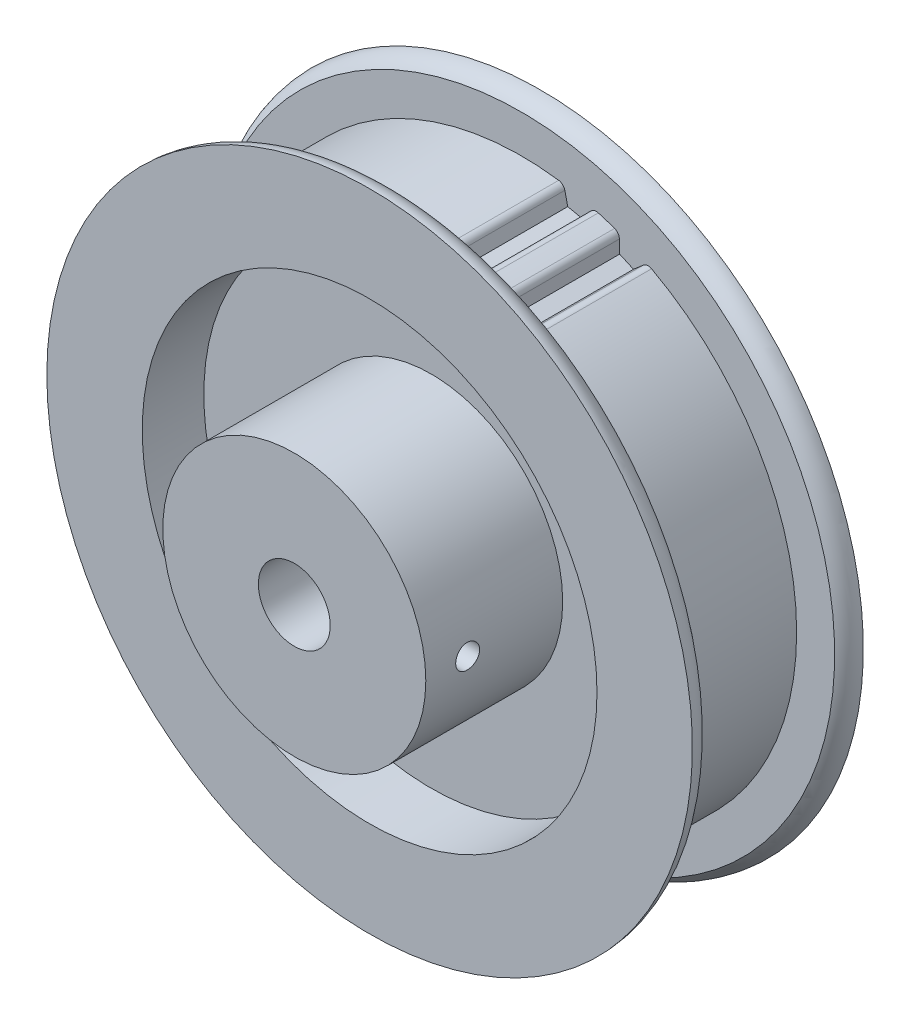
ISO-10303-21;
HEADER;
FILE_DESCRIPTION(('STEP AP214'),'2;1');
FILE_NAME('part.step','',(''),(''),'','','');
FILE_SCHEMA(('AUTOMOTIVE_DESIGN { 1 0 10303 214 1 1 1 1 }'));
ENDSEC;
DATA;
#1=APPLICATION_CONTEXT('core data for automotive mechanical design processes');
#2=APPLICATION_PROTOCOL_DEFINITION('international standard','automotive_design',2000,#1);
#3=PRODUCT_CONTEXT('',#1,'mechanical');
#4=PRODUCT('Part','Part','',(#3));
#5=PRODUCT_RELATED_PRODUCT_CATEGORY('part','',(#4));
#6=PRODUCT_DEFINITION_FORMATION('','',#4);
#7=PRODUCT_DEFINITION_CONTEXT('part definition',#1,'design');
#8=PRODUCT_DEFINITION('design','',#6,#7);
#9=PRODUCT_DEFINITION_SHAPE('','',#8);
#10=(LENGTH_UNIT() NAMED_UNIT(*) SI_UNIT(.MILLI.,.METRE.));
#11=(NAMED_UNIT(*) PLANE_ANGLE_UNIT() SI_UNIT($,.RADIAN.));
#12=(NAMED_UNIT(*) SI_UNIT($,.STERADIAN.) SOLID_ANGLE_UNIT());
#13=UNCERTAINTY_MEASURE_WITH_UNIT(LENGTH_MEASURE(1.E-05),#10,'distance_accuracy_value','');
#14=(GEOMETRIC_REPRESENTATION_CONTEXT(3) GLOBAL_UNCERTAINTY_ASSIGNED_CONTEXT((#13)) GLOBAL_UNIT_ASSIGNED_CONTEXT((#10,
#11,#12)) REPRESENTATION_CONTEXT('',''));
#15=CARTESIAN_POINT('',(0.,0.,0.));
#16=DIRECTION('',(0.,0.,1.));
#17=DIRECTION('',(1.,0.,0.));
#18=AXIS2_PLACEMENT_3D('',#15,#16,#17);
#19=CARTESIAN_POINT('',(0.,0.,-7.865));
#20=DIRECTION('',(0.,0.,1.));
#21=DIRECTION('',(1.,0.,0.));
#22=AXIS2_PLACEMENT_3D('',#19,#20,#21);
#23=CYLINDRICAL_SURFACE('',#22,3.00625);
#24=CARTESIAN_POINT('',(0.,0.,13.45));
#25=DIRECTION('',(0.,0.,1.));
#26=DIRECTION('',(1.,0.,0.));
#27=AXIS2_PLACEMENT_3D('',#24,#25,#26);
#28=CIRCLE('',#27,3.00625);
#29=CARTESIAN_POINT('',(3.00625,0.,13.45));
#30=VERTEX_POINT('',#29);
#31=EDGE_CURVE('E668',#30,#30,#28,.F.);
#32=ORIENTED_EDGE('',*,*,#31,.F.);
#33=EDGE_LOOP('',(#32));
#34=FACE_BOUND('',#33,.T.);
#35=CARTESIAN_POINT('',(2.83505538967054,-1.,9.95));
#36=CARTESIAN_POINT('',(2.83505805521726,-0.999996860829534,9.89560012240531));
#37=CARTESIAN_POINT('',(2.83664092720275,-0.995539628982452,9.84114356229328));
#38=CARTESIAN_POINT('',(2.84278029352672,-0.977866267559119,9.73378845301384));
#39=CARTESIAN_POINT('',(2.84734185394725,-0.964635215082974,9.68089271894788));
#40=CARTESIAN_POINT('',(2.85886276493882,-0.929932047551878,9.57831487311199));
#41=CARTESIAN_POINT('',(2.86581595404735,-0.908481093078195,9.52862488936154));
#42=CARTESIAN_POINT('',(2.88132861772083,-0.85800851131405,9.43355077888805));
#43=CARTESIAN_POINT('',(2.88988794328122,-0.828987586207924,9.38816625332639));
#44=CARTESIAN_POINT('',(2.90802514645595,-0.762980154462313,9.30119659752729));
#45=CARTESIAN_POINT('',(2.91762839752182,-0.725747418235904,9.25980357147626));
#46=CARTESIAN_POINT('',(2.9365572425231,-0.644897226191834,9.18371667960365));
#47=CARTESIAN_POINT('',(2.94588277761681,-0.601278428732987,9.14902422505916));
#48=CARTESIAN_POINT('',(2.96349731218182,-0.507497701326585,9.0864585773574));
#49=CARTESIAN_POINT('',(2.97175313863212,-0.457195363937249,9.05878567814415));
#50=CARTESIAN_POINT('',(2.98600044492719,-0.352328255845483,9.01237001183178));
#51=CARTESIAN_POINT('',(2.99199254200767,-0.297764651937208,8.9936248101141));
#52=CARTESIAN_POINT('',(3.00085820819363,-0.18793067543891,8.9662452880797));
#53=CARTESIAN_POINT('',(3.00383266206768,-0.132750339237902,8.95728305985227));
#54=CARTESIAN_POINT('',(3.00668595141732,-0.0215942380519739,8.94868139573731));
#55=CARTESIAN_POINT('',(3.0065655808289,0.0343813192469164,8.94903956882523));
#56=CARTESIAN_POINT('',(3.00331121605878,0.143218101675799,8.95886027092679));
#57=CARTESIAN_POINT('',(3.00029512433452,0.19611556885254,8.96796661718219));
#58=CARTESIAN_POINT('',(2.99173611710719,0.299583787679702,8.9944363792984));
#59=CARTESIAN_POINT('',(2.98619302001733,0.350154371836262,9.0118003885463));
#60=CARTESIAN_POINT('',(2.97305224963023,0.448314503969328,9.05450171799445));
#61=CARTESIAN_POINT('',(2.96542853618524,0.495856149440983,9.07994080977365));
#62=CARTESIAN_POINT('',(2.9489209370939,0.586098821903409,9.13798504182922));
#63=CARTESIAN_POINT('',(2.94003676787983,0.628798755742992,9.17059179554078));
#64=CARTESIAN_POINT('',(2.92145432368061,0.710261444445991,9.24383625581745));
#65=CARTESIAN_POINT('',(2.91173740613105,0.748746825603025,9.28477813729732));
#66=CARTESIAN_POINT('',(2.89293146373067,0.818408421259538,9.37263406604175));
#67=CARTESIAN_POINT('',(2.88384274942274,0.849581038774795,9.41955103488553));
#68=CARTESIAN_POINT('',(2.86721813322962,0.904116550311982,9.518916082822));
#69=CARTESIAN_POINT('',(2.85970728458455,0.927356644993606,9.57143592929314));
#70=CARTESIAN_POINT('',(2.84738666422368,0.964529947944262,9.6798999307465));
#71=CARTESIAN_POINT('',(2.84257116596637,0.978482899708677,9.73583654366407));
#72=CARTESIAN_POINT('',(2.83797968136899,0.991678199536366,9.8185815857425));
#73=CARTESIAN_POINT('',(2.83688686383255,0.994794901889274,9.84475160224009));
#74=CARTESIAN_POINT('',(2.83542407020799,0.998956567971282,9.89727663943035));
#75=CARTESIAN_POINT('',(2.83505409764486,1.00000152159737,9.92363166102458));
#76=CARTESIAN_POINT('',(2.83505805521726,0.999996860829534,10.0043998775947));
#77=CARTESIAN_POINT('',(2.83664092720275,0.995539628982452,10.0588564377067));
#78=CARTESIAN_POINT('',(2.84278029352672,0.977866267559119,10.1662115469862));
#79=CARTESIAN_POINT('',(2.84734185394725,0.964635215082974,10.2191072810521));
#80=CARTESIAN_POINT('',(2.85886276493882,0.929932047551878,10.321685126888));
#81=CARTESIAN_POINT('',(2.86581595404735,0.908481093078195,10.3713751106385));
#82=CARTESIAN_POINT('',(2.88132861772083,0.858008511314049,10.4664492211119));
#83=CARTESIAN_POINT('',(2.88988794328122,0.828987586207924,10.5118337466736));
#84=CARTESIAN_POINT('',(2.90802514645595,0.762980154462313,10.5988034024727));
#85=CARTESIAN_POINT('',(2.91762839752182,0.725747418235904,10.6401964285237));
#86=CARTESIAN_POINT('',(2.9365572425231,0.644897226191834,10.7162833203963));
#87=CARTESIAN_POINT('',(2.94588277761681,0.601278428732987,10.7509757749408));
#88=CARTESIAN_POINT('',(2.96349731218182,0.507497701326584,10.8135414226426));
#89=CARTESIAN_POINT('',(2.97175313863212,0.457195363937248,10.8412143218558));
#90=CARTESIAN_POINT('',(2.98600044492719,0.352328255845482,10.8876299881682));
#91=CARTESIAN_POINT('',(2.99199254200767,0.297764651937208,10.9063751898859));
#92=CARTESIAN_POINT('',(3.00085820819363,0.18793067543891,10.9337547119203));
#93=CARTESIAN_POINT('',(3.00383266206768,0.132750339237901,10.9427169401477));
#94=CARTESIAN_POINT('',(3.00668595141732,0.0215942380519736,10.9513186042627));
#95=CARTESIAN_POINT('',(3.0065655808289,-0.0343813192469166,10.9509604311748));
#96=CARTESIAN_POINT('',(3.00331121605878,-0.143218101675799,10.9411397290732));
#97=CARTESIAN_POINT('',(3.00029512433452,-0.19611556885254,10.9320333828178));
#98=CARTESIAN_POINT('',(2.99173611710719,-0.299583787679702,10.9055636207016));
#99=CARTESIAN_POINT('',(2.98619302001733,-0.350154371836262,10.8881996114537));
#100=CARTESIAN_POINT('',(2.97305224963023,-0.448314503969328,10.8454982820055));
#101=CARTESIAN_POINT('',(2.96542853618524,-0.495856149440983,10.8200591902263));
#102=CARTESIAN_POINT('',(2.9489209370939,-0.586098821903409,10.7620149581708));
#103=CARTESIAN_POINT('',(2.94003676787983,-0.628798755742992,10.7294082044592));
#104=CARTESIAN_POINT('',(2.92145432368061,-0.710261444445991,10.6561637441825));
#105=CARTESIAN_POINT('',(2.91173740613105,-0.748746825603025,10.6152218627027));
#106=CARTESIAN_POINT('',(2.89293146373067,-0.818408421259538,10.5273659339582));
#107=CARTESIAN_POINT('',(2.88384274942274,-0.849581038774795,10.4804489651145));
#108=CARTESIAN_POINT('',(2.86721813322962,-0.904116550311982,10.381083917178));
#109=CARTESIAN_POINT('',(2.85970728458455,-0.927356644993605,10.3285640707069));
#110=CARTESIAN_POINT('',(2.84738666422368,-0.964529947944262,10.2201000692535));
#111=CARTESIAN_POINT('',(2.84257116596637,-0.978482899708677,10.1641634563359));
#112=CARTESIAN_POINT('',(2.83797968136899,-0.991678199536366,10.0814184142575));
#113=CARTESIAN_POINT('',(2.83688686383255,-0.994794901889274,10.0552483977599));
#114=CARTESIAN_POINT('',(2.83542407020799,-0.998956567971282,10.0027233605696));
#115=CARTESIAN_POINT('',(2.83505409764486,-1.00000152159737,9.97636833897542));
#116=CARTESIAN_POINT('',(2.83505538967054,-1.,9.95));
#117=B_SPLINE_CURVE_WITH_KNOTS('',3,(#35,#36,#37,#38,#39,#40,#41,#42,#43,#44,#45,#46,#47,#48,
#49,#50,#51,#52,#53,#54,#55,#56,#57,#58,#59,#60,#61,#62,#63,#64,#65,#66,#67,#68,#69,#70,#71,#72,
#73,#74,#75,#76,#77,#78,#79,#80,#81,#82,#83,#84,#85,#86,#87,#88,#89,#90,#91,#92,#93,#94,#95,#96,
#97,#98,#99,#100,#101,#102,#103,#104,#105,#106,#107,#108,#109,#110,#111,#112,#113,#114,#115,
#116),.UNSPECIFIED.,.T.,.F.,(4,2,2,2,2,2,2,2,2,2,2,2,2,2,2,2,2,2,2,2,2,2,2,2,2,2,2,2,2,2,2,2,2,
2,2,2,2,2,2,2,4),(0.,0.163097193528566,0.326472503894794,0.489430030630399,0.652372446929972,
0.82110001060895,0.989863073094611,1.16300499130044,1.33609966594337,1.50319520005849,
1.67024786846742,1.83077509092815,1.99131385045194,2.15396209645025,2.31664699200341,
2.48693714412507,2.65731088333809,2.83021371070307,3.00274778061822,3.0818027583693,
3.16085812163579,3.32395531516436,3.48733062553059,3.65028815226619,3.81323056856576,
3.98195813224474,4.1507211947304,4.32386311293623,4.49695778757916,4.66405332169428,
4.83110599010321,4.99163321256395,5.15217197208773,5.31482021808604,5.4775051136392,
5.64779526576086,5.81816900497388,5.99107183233886,6.16360590225401,6.2426608800051,
6.32171624327158),.UNSPECIFIED.);
#118=CARTESIAN_POINT('',(2.83505538967054,-1.,9.95));
#119=VERTEX_POINT('',#118);
#120=EDGE_CURVE('E20',#119,#119,#117,.T.);
#121=ORIENTED_EDGE('',*,*,#120,.T.);
#122=EDGE_LOOP('',(#121));
#123=FACE_BOUND('',#122,.T.);
#124=CARTESIAN_POINT('',(0.,0.,-7.15));
#125=DIRECTION('',(0.,0.,1.));
#126=DIRECTION('',(1.,0.,0.));
#127=AXIS2_PLACEMENT_3D('',#124,#125,#126);
#128=CIRCLE('',#127,3.00625);
#129=CARTESIAN_POINT('',(3.00625,0.,-7.15));
#130=VERTEX_POINT('',#129);
#131=EDGE_CURVE('E154',#130,#130,#128,.F.);
#132=ORIENTED_EDGE('',*,*,#131,.T.);
#133=EDGE_LOOP('',(#132));
#134=FACE_BOUND('',#133,.T.);
#135=ADVANCED_FACE('F16',(#34,#123,#134),#23,.F.);
#136=CARTESIAN_POINT('',(11.,0.,9.95));
#137=DIRECTION('',(1.,0.,0.));
#138=DIRECTION('',(0.,0.,-1.));
#139=AXIS2_PLACEMENT_3D('',#136,#137,#138);
#140=CYLINDRICAL_SURFACE('',#139,1.);
#141=CARTESIAN_POINT('',(10.9544511501033,1.,9.95));
#142=CARTESIAN_POINT('',(10.9544521010421,0.999995465806139,9.89398789159639));
#143=CARTESIAN_POINT('',(10.9548855550431,0.995276607498848,9.83792800077017));
#144=CARTESIAN_POINT('',(10.9565741393202,0.976507885149056,9.72730947267031));
#145=CARTESIAN_POINT('',(10.9578310019657,0.962438347309499,9.67275425381741));
#146=CARTESIAN_POINT('',(10.9610225301102,0.925380458315825,9.56683665820912));
#147=CARTESIAN_POINT('',(10.9629565440386,0.902400678526648,9.51547126786764));
#148=CARTESIAN_POINT('',(10.9672836002824,0.848189854870116,9.41735099029744));
#149=CARTESIAN_POINT('',(10.9696764393178,0.816962462756972,9.37059407514755));
#150=CARTESIAN_POINT('',(10.9746602233034,0.747035116212915,9.28284602018282));
#151=CARTESIAN_POINT('',(10.9772517010994,0.708314605531758,9.24187129028223));
#152=CARTESIAN_POINT('',(10.982336019092,0.624542161700969,9.16699060810337));
#153=CARTESIAN_POINT('',(10.9848288500914,0.579489639972202,9.13308531367844));
#154=CARTESIAN_POINT('',(10.9894397878102,0.484238626112987,9.07325527999317));
#155=CARTESIAN_POINT('',(10.991557247723,0.434031482538751,9.04734425998144));
#156=CARTESIAN_POINT('',(10.9951733302334,0.32995705997787,9.00432635732913));
#157=CARTESIAN_POINT('',(10.9966719708942,0.276089887880719,8.98721921770017));
#158=CARTESIAN_POINT('',(10.9988779832852,0.166382987214136,8.96234037578525));
#159=CARTESIAN_POINT('',(10.9995875436351,0.110549160035347,8.95454284759585));
#160=CARTESIAN_POINT('',(11.0001428771312,-0.00163904274151358,8.94842470741085));
#161=CARTESIAN_POINT('',(10.9999886675461,-0.0579934079103412,8.9501039059536));
#162=CARTESIAN_POINT('',(10.99883563756,-0.169447164110139,8.96287047441439));
#163=CARTESIAN_POINT('',(10.9978393180548,-0.224549775561645,8.97392998703932));
#164=CARTESIAN_POINT('',(10.9951169532007,-0.332113902994738,9.00510006291449));
#165=CARTESIAN_POINT('',(10.9933908930964,-0.384575365547912,9.02521080918249));
#166=CARTESIAN_POINT('',(10.9893988051089,-0.485457449331559,9.07394413687794));
#167=CARTESIAN_POINT('',(10.9871319723771,-0.533871900834383,9.10257942153751));
#168=CARTESIAN_POINT('',(10.9823131764702,-0.625213882856173,9.16753710224376));
#169=CARTESIAN_POINT('',(10.9797612301108,-0.668141736652299,9.20385904504777));
#170=CARTESIAN_POINT('',(10.9746482270433,-0.747451930637018,9.28330883229046));
#171=CARTESIAN_POINT('',(10.9720871690793,-0.78381133981466,9.3264595695453));
#172=CARTESIAN_POINT('',(10.9672521537064,-0.84879090307722,9.41828724757729));
#173=CARTESIAN_POINT('',(10.9649783301658,-0.877407455575645,9.46696674515946));
#174=CARTESIAN_POINT('',(10.9609745662467,-0.926086261963935,9.56850424007557));
#175=CARTESIAN_POINT('',(10.9592451620423,-0.946140089692922,9.62136629292081));
#176=CARTESIAN_POINT('',(10.956534414202,-0.977035820973891,9.72963967033318));
#177=CARTESIAN_POINT('',(10.9555514831302,-0.987897278513587,9.78504531795556));
#178=CARTESIAN_POINT('',(10.9546329496568,-0.998010780969819,9.87714388505708));
#179=CARTESIAN_POINT('',(10.9544505314788,-1.00000294967863,9.91356183168469));
#180=CARTESIAN_POINT('',(10.9544521010421,-0.999995465806139,10.0060121084036));
#181=CARTESIAN_POINT('',(10.9548855550431,-0.995276607498848,10.0620719992298));
#182=CARTESIAN_POINT('',(10.9565741393202,-0.976507885149055,10.1726905273297));
#183=CARTESIAN_POINT('',(10.9578310019657,-0.962438347309497,10.2272457461826));
#184=CARTESIAN_POINT('',(10.9610225301102,-0.925380458315824,10.3331633417909));
#185=CARTESIAN_POINT('',(10.9629565440386,-0.902400678526647,10.3845287321324));
#186=CARTESIAN_POINT('',(10.9672836002824,-0.848189854870116,10.4826490097026));
#187=CARTESIAN_POINT('',(10.9696764393178,-0.816962462756971,10.5294059248524));
#188=CARTESIAN_POINT('',(10.9746602233034,-0.747035116212913,10.6171539798172));
#189=CARTESIAN_POINT('',(10.9772517010994,-0.708314605531757,10.6581287097178));
#190=CARTESIAN_POINT('',(10.982336019092,-0.624542161700967,10.7330093918966));
#191=CARTESIAN_POINT('',(10.9848288500914,-0.579489639972199,10.7669146863216));
#192=CARTESIAN_POINT('',(10.9894397878102,-0.484238626112983,10.8267447200068));
#193=CARTESIAN_POINT('',(10.991557247723,-0.434031482538747,10.8526557400186));
#194=CARTESIAN_POINT('',(10.9951733302334,-0.329957059977865,10.8956736426709));
#195=CARTESIAN_POINT('',(10.9966719708942,-0.276089887880715,10.9127807822998));
#196=CARTESIAN_POINT('',(10.9988779832852,-0.166382987214132,10.9376596242147));
#197=CARTESIAN_POINT('',(10.9995875436351,-0.110549160035343,10.9454571524041));
#198=CARTESIAN_POINT('',(11.0001428771312,0.00163904274151766,10.9515752925892));
#199=CARTESIAN_POINT('',(10.9999886675461,0.0579934079103452,10.9498960940464));
#200=CARTESIAN_POINT('',(10.99883563756,0.169447164110142,10.9371295255856));
#201=CARTESIAN_POINT('',(10.9978393180548,0.224549775561648,10.9260700129607));
#202=CARTESIAN_POINT('',(10.9951169532007,0.332113902994742,10.8948999370855));
#203=CARTESIAN_POINT('',(10.9933908930964,0.384575365547915,10.8747891908175));
#204=CARTESIAN_POINT('',(10.9893988051089,0.485457449331562,10.8260558631221));
#205=CARTESIAN_POINT('',(10.9871319723771,0.533871900834386,10.7974205784625));
#206=CARTESIAN_POINT('',(10.9823131764702,0.625213882856176,10.7324628977562));
#207=CARTESIAN_POINT('',(10.9797612301108,0.668141736652301,10.6961409549522));
#208=CARTESIAN_POINT('',(10.9746482270433,0.747451930637019,10.6166911677095));
#209=CARTESIAN_POINT('',(10.9720871690793,0.783811339814661,10.5735404304547));
#210=CARTESIAN_POINT('',(10.9672521537064,0.848790903077221,10.4817127524227));
#211=CARTESIAN_POINT('',(10.9649783301658,0.877407455575646,10.4330332548405));
#212=CARTESIAN_POINT('',(10.9609745662467,0.926086261963936,10.3314957599244));
#213=CARTESIAN_POINT('',(10.9592451620423,0.946140089692923,10.2786337070792));
#214=CARTESIAN_POINT('',(10.956534414202,0.977035820973891,10.1703603296668));
#215=CARTESIAN_POINT('',(10.9555514831302,0.987897278513588,10.1149546820444));
#216=CARTESIAN_POINT('',(10.9546329496568,0.998010780969819,10.0228561149429));
#217=CARTESIAN_POINT('',(10.9544505314788,1.00000294967863,9.98643816831531));
#218=CARTESIAN_POINT('',(10.9544511501033,1.,9.95));
#219=B_SPLINE_CURVE_WITH_KNOTS('',3,(#141,#142,#143,#144,#145,#146,#147,#148,#149,#150,#151,
#152,#153,#154,#155,#156,#157,#158,#159,#160,#161,#162,#163,#164,#165,#166,#167,#168,#169,#170,
#171,#172,#173,#174,#175,#176,#177,#178,#179,#180,#181,#182,#183,#184,#185,#186,#187,#188,#189,
#190,#191,#192,#193,#194,#195,#196,#197,#198,#199,#200,#201,#202,#203,#204,#205,#206,#207,#208,
#209,#210,#211,#212,#213,#214,#215,#216,#217,#218),.UNSPECIFIED.,.T.,.F.,(4,2,2,2,2,2,2,2,2,2,2,
2,2,2,2,2,2,2,2,2,2,2,2,2,2,2,2,2,2,2,2,2,2,2,2,2,2,2,4),(0.,0.167920676476862,
0.336195780709346,0.504309409731902,0.672348728342283,0.84085574569132,1.0093784366373,
1.17818874681982,1.34699412909004,1.51533013012304,1.68366276574278,1.85149723696999,
2.01933510199657,2.18742434111261,2.35550367163133,2.52415889640948,2.69289243675202,
2.86179163902046,3.03033064976165,3.13956992047424,3.3074905969511,3.47576570118359,
3.64387933020614,3.81191864881652,3.98042566616556,4.14894835711154,4.31775866729406,
4.48656404956428,4.65490005059728,4.82323268621702,4.99106715744424,5.15890502247081,
5.32699426158685,5.49507359210557,5.66372881688372,5.83246235722627,6.00136155949471,
6.16990057023589,6.27913984094848),.UNSPECIFIED.);
#220=CARTESIAN_POINT('',(10.9544511501033,1.,9.95));
#221=VERTEX_POINT('',#220);
#222=EDGE_CURVE('E147',#221,#221,#219,.T.);
#223=ORIENTED_EDGE('',*,*,#222,.F.);
#224=EDGE_LOOP('',(#223));
#225=FACE_BOUND('',#224,.T.);
#226=ORIENTED_EDGE('',*,*,#120,.F.);
#227=EDGE_LOOP('',(#226));
#228=FACE_BOUND('',#227,.T.);
#229=ADVANCED_FACE('F155',(#225,#228),#140,.F.);
#230=CARTESIAN_POINT('',(0.,0.,13.45));
#231=DIRECTION('',(0.,0.,1.));
#232=DIRECTION('',(1.,0.,0.));
#233=AXIS2_PLACEMENT_3D('',#230,#231,#232);
#234=PLANE('',#233);
#235=ORIENTED_EDGE('',*,*,#31,.T.);
#236=EDGE_LOOP('',(#235));
#237=FACE_BOUND('',#236,.T.);
#238=CARTESIAN_POINT('',(0.,0.,13.45));
#239=DIRECTION('',(0.,0.,1.));
#240=DIRECTION('',(1.,0.,0.));
#241=AXIS2_PLACEMENT_3D('',#238,#239,#240);
#242=CIRCLE('',#241,11.);
#243=CARTESIAN_POINT('',(11.,0.,13.45));
#244=VERTEX_POINT('',#243);
#245=EDGE_CURVE('E143',#244,#244,#242,.F.);
#246=ORIENTED_EDGE('',*,*,#245,.F.);
#247=EDGE_LOOP('',(#246));
#248=FACE_BOUND('',#247,.T.);
#249=ADVANCED_FACE('F168',(#237,#248),#234,.T.);
#250=CARTESIAN_POINT('',(0.,0.,-7.15));
#251=DIRECTION('',(0.,0.,1.));
#252=DIRECTION('',(1.,0.,0.));
#253=AXIS2_PLACEMENT_3D('',#250,#251,#252);
#254=PLANE('',#253);
#255=ORIENTED_EDGE('',*,*,#131,.F.);
#256=EDGE_LOOP('',(#255));
#257=FACE_BOUND('',#256,.T.);
#258=CARTESIAN_POINT('',(0.,0.,-7.15));
#259=DIRECTION('',(0.,0.,1.));
#260=DIRECTION('',(1.,0.,0.));
#261=AXIS2_PLACEMENT_3D('',#258,#259,#260);
#262=CIRCLE('',#261,11.);
#263=CARTESIAN_POINT('',(11.,0.,-7.15));
#264=VERTEX_POINT('',#263);
#265=EDGE_CURVE('E97',#264,#264,#262,.T.);
#266=ORIENTED_EDGE('',*,*,#265,.F.);
#267=EDGE_LOOP('',(#266));
#268=FACE_BOUND('',#267,.T.);
#269=ADVANCED_FACE('F164',(#257,#268),#254,.F.);
#270=CARTESIAN_POINT('',(0.,0.,6.835));
#271=DIRECTION('',(0.,0.,1.));
#272=DIRECTION('',(1.,0.,0.));
#273=AXIS2_PLACEMENT_3D('',#270,#271,#272);
#274=CYLINDRICAL_SURFACE('',#273,11.);
#275=CARTESIAN_POINT('',(0.,0.,2.));
#276=DIRECTION('',(0.,0.,1.));
#277=DIRECTION('',(1.,0.,0.));
#278=AXIS2_PLACEMENT_3D('',#275,#276,#277);
#279=CIRCLE('',#278,11.);
#280=CARTESIAN_POINT('',(11.,0.,2.));
#281=VERTEX_POINT('',#280);
#282=EDGE_CURVE('E134',#281,#281,#279,.F.);
#283=ORIENTED_EDGE('',*,*,#282,.F.);
#284=EDGE_LOOP('',(#283));
#285=FACE_BOUND('',#284,.T.);
#286=ORIENTED_EDGE('',*,*,#245,.T.);
#287=EDGE_LOOP('',(#286));
#288=FACE_BOUND('',#287,.T.);
#289=ORIENTED_EDGE('',*,*,#222,.T.);
#290=EDGE_LOOP('',(#289));
#291=FACE_BOUND('',#290,.T.);
#292=ADVANCED_FACE('F158',(#285,#288,#291),#274,.T.);
#293=CARTESIAN_POINT('',(0.,0.,-7.865));
#294=DIRECTION('',(0.,0.,1.));
#295=DIRECTION('',(1.,0.,0.));
#296=AXIS2_PLACEMENT_3D('',#293,#294,#295);
#297=CYLINDRICAL_SURFACE('',#296,11.);
#298=CARTESIAN_POINT('',(0.,0.,-2.));
#299=DIRECTION('',(0.,0.,1.));
#300=DIRECTION('',(1.,0.,0.));
#301=AXIS2_PLACEMENT_3D('',#298,#299,#300);
#302=CIRCLE('',#301,11.);
#303=CARTESIAN_POINT('',(11.,0.,-2.));
#304=VERTEX_POINT('',#303);
#305=EDGE_CURVE('E119',#304,#304,#302,.F.);
#306=ORIENTED_EDGE('',*,*,#305,.T.);
#307=EDGE_LOOP('',(#306));
#308=FACE_BOUND('',#307,.T.);
#309=ORIENTED_EDGE('',*,*,#265,.T.);
#310=EDGE_LOOP('',(#309));
#311=FACE_BOUND('',#310,.T.);
#312=ADVANCED_FACE('F163',(#308,#311),#297,.T.);
#313=CARTESIAN_POINT('',(0.,0.,-7.865));
#314=DIRECTION('',(0.,0.,1.));
#315=DIRECTION('',(1.,0.,0.));
#316=AXIS2_PLACEMENT_3D('',#313,#314,#315);
#317=CYLINDRICAL_SURFACE('',#316,23.02);
#318=CARTESIAN_POINT('',(0.,0.,5.55));
#319=DIRECTION('',(0.,0.,1.));
#320=DIRECTION('',(1.,0.,0.));
#321=AXIS2_PLACEMENT_3D('',#318,#319,#320);
#322=CIRCLE('',#321,23.02);
#323=CARTESIAN_POINT('',(6.42917604644562,22.1039836989582,5.55));
#324=VERTEX_POINT('',#323);
#325=CARTESIAN_POINT('',(7.79108295415668,21.6614733201972,5.55));
#326=VERTEX_POINT('',#325);
#327=EDGE_CURVE('E96',#324,#326,#322,.F.);
#328=ORIENTED_EDGE('',*,*,#327,.T.);
#329=DIRECTION('',(0.,0.,1.));
#330=VECTOR('',#329,1.);
#331=CARTESIAN_POINT('',(7.79108295455584,21.6614733200536,5.55));
#332=LINE('',#331,#330);
#333=CARTESIAN_POINT('',(7.79108295415608,21.6614733201955,-5.55));
#334=VERTEX_POINT('',#333);
#335=EDGE_CURVE('E101',#334,#326,#332,.T.);
#336=ORIENTED_EDGE('',*,*,#335,.F.);
#337=CARTESIAN_POINT('',(0.,0.,-5.55));
#338=DIRECTION('',(0.,0.,1.));
#339=DIRECTION('',(1.,0.,0.));
#340=AXIS2_PLACEMENT_3D('',#337,#338,#339);
#341=CIRCLE('',#340,23.02);
#342=CARTESIAN_POINT('',(6.42919155528518,22.1039791879349,-5.55));
#343=VERTEX_POINT('',#342);
#344=EDGE_CURVE('E82',#334,#343,#341,.T.);
#345=ORIENTED_EDGE('',*,*,#344,.T.);
#346=CARTESIAN_POINT('',(6.4291760464455,22.1039836989583,5.55));
#347=CARTESIAN_POINT('',(6.42917669264673,22.1039835110039,5.0875));
#348=CARTESIAN_POINT('',(6.42917733884765,22.1039833230484,4.625));
#349=CARTESIAN_POINT('',(6.42917863124887,22.1039829471352,3.7));
#350=CARTESIAN_POINT('',(6.42917927744916,22.1039827591776,3.2375));
#351=CARTESIAN_POINT('',(6.42918056984914,22.1039823832602,2.3125));
#352=CARTESIAN_POINT('',(6.42918121604881,22.1039821953004,1.85));
#353=CARTESIAN_POINT('',(6.42918250844754,22.1039818193788,0.925));
#354=CARTESIAN_POINT('',(6.42918315464659,22.1039816314169,0.4625));
#355=CARTESIAN_POINT('',(6.42918444704408,22.1039812554909,-0.4625));
#356=CARTESIAN_POINT('',(6.42918509324251,22.1039810675269,-0.925));
#357=CARTESIAN_POINT('',(6.42918638563875,22.1039806915966,-1.85));
#358=CARTESIAN_POINT('',(6.42918703183656,22.1039805036304,-2.3125));
#359=CARTESIAN_POINT('',(6.42918832423156,22.1039801276959,-3.2375));
#360=CARTESIAN_POINT('',(6.42918897042874,22.1039799397276,-3.7));
#361=CARTESIAN_POINT('',(6.42919026282249,22.1039795637888,-4.625));
#362=CARTESIAN_POINT('',(6.42919090901906,22.1039793758184,-5.0875));
#363=CARTESIAN_POINT('',(6.42919155521531,22.1039791878468,-5.55));
#364=B_SPLINE_CURVE_WITH_KNOTS('',3,(#346,#347,#348,#349,#350,#351,#352,#353,#354,#355,#356,
#357,#358,#359,#360,#361,#362,#363),.UNSPECIFIED.,.F.,.F.,(4,2,2,2,2,2,2,2,4),(0.,
1.38750000000147,2.77500000000294,4.16250000000441,5.55000000000588,6.93750000000735,
8.32500000000882,9.71250000001028,11.1000000000118),.UNSPECIFIED.);
#365=EDGE_CURVE('E127',#324,#343,#364,.T.);
#366=ORIENTED_EDGE('',*,*,#365,.F.);
#367=EDGE_LOOP('',(#328,#336,#345,#366));
#368=FACE_BOUND('',#367,.T.);
#369=ADVANCED_FACE('F102',(#368),#317,.T.);
#370=CARTESIAN_POINT('',(0.,0.,2.));
#371=DIRECTION('',(0.,0.,1.));
#372=DIRECTION('',(1.,0.,0.));
#373=AXIS2_PLACEMENT_3D('',#370,#371,#372);
#374=PLANE('',#373);
#375=ORIENTED_EDGE('',*,*,#282,.T.);
#376=EDGE_LOOP('',(#375));
#377=FACE_BOUND('',#376,.T.);
#378=CARTESIAN_POINT('',(0.,0.,2.));
#379=DIRECTION('',(0.,0.,1.));
#380=DIRECTION('',(1.,0.,0.));
#381=AXIS2_PLACEMENT_3D('',#378,#379,#380);
#382=CIRCLE('',#381,19.02);
#383=CARTESIAN_POINT('',(19.02,0.,2.));
#384=VERTEX_POINT('',#383);
#385=EDGE_CURVE('E106',#384,#384,#382,.T.);
#386=ORIENTED_EDGE('',*,*,#385,.T.);
#387=EDGE_LOOP('',(#386));
#388=FACE_BOUND('',#387,.T.);
#389=ADVANCED_FACE('F351',(#377,#388),#374,.T.);
#390=CARTESIAN_POINT('',(6.258811259811,21.51825693717,5.55));
#391=DIRECTION('',(0.,0.,1.));
#392=DIRECTION('',(1.,0.,0.));
#393=AXIS2_PLACEMENT_3D('',#390,#391,#392);
#394=CYLINDRICAL_SURFACE('',#393,0.61);
#395=CARTESIAN_POINT('',(6.258811259811,21.51825693717,5.55));
#396=DIRECTION('',(0.,0.,1.));
#397=DIRECTION('',(1.,0.,0.));
#398=AXIS2_PLACEMENT_3D('',#395,#396,#397);
#399=CIRCLE('',#398,0.61);
#400=CARTESIAN_POINT('',(5.77164359867947,21.8853641012933,5.55));
#401=VERTEX_POINT('',#400);
#402=EDGE_CURVE('E128',#401,#324,#399,.F.);
#403=ORIENTED_EDGE('',*,*,#402,.T.);
#404=ORIENTED_EDGE('',*,*,#365,.T.);
#405=CARTESIAN_POINT('',(6.258811259811,21.51825693717,-5.55));
#406=DIRECTION('',(0.,0.,1.));
#407=DIRECTION('',(1.,0.,0.));
#408=AXIS2_PLACEMENT_3D('',#405,#406,#407);
#409=CIRCLE('',#408,0.61);
#410=CARTESIAN_POINT('',(5.77164359867947,21.8853641012933,-5.55));
#411=VERTEX_POINT('',#410);
#412=EDGE_CURVE('E91',#343,#411,#409,.T.);
#413=ORIENTED_EDGE('',*,*,#412,.T.);
#414=DIRECTION('',(0.,0.,1.));
#415=VECTOR('',#414,1.);
#416=CARTESIAN_POINT('',(5.77164359867878,21.8853641012924,5.55));
#417=LINE('',#416,#415);
#418=EDGE_CURVE('E316',#411,#401,#417,.T.);
#419=ORIENTED_EDGE('',*,*,#418,.T.);
#420=EDGE_LOOP('',(#403,#404,#413,#419));
#421=FACE_BOUND('',#420,.T.);
#422=ADVANCED_FACE('F340',(#421),#394,.T.);
#423=CARTESIAN_POINT('',(0.,0.,-2.));
#424=DIRECTION('',(0.,0.,1.));
#425=DIRECTION('',(1.,0.,0.));
#426=AXIS2_PLACEMENT_3D('',#423,#424,#425);
#427=PLANE('',#426);
#428=ORIENTED_EDGE('',*,*,#305,.F.);
#429=EDGE_LOOP('',(#428));
#430=FACE_BOUND('',#429,.T.);
#431=CARTESIAN_POINT('',(0.,0.,-2.));
#432=DIRECTION('',(0.,0.,1.));
#433=DIRECTION('',(1.,0.,0.));
#434=AXIS2_PLACEMENT_3D('',#431,#432,#433);
#435=CIRCLE('',#434,19.02);
#436=CARTESIAN_POINT('',(19.02,0.,-2.));
#437=VERTEX_POINT('',#436);
#438=EDGE_CURVE('E310',#437,#437,#435,.F.);
#439=ORIENTED_EDGE('',*,*,#438,.T.);
#440=EDGE_LOOP('',(#439));
#441=FACE_BOUND('',#440,.T.);
#442=ADVANCED_FACE('F350',(#430,#441),#427,.F.);
#443=CARTESIAN_POINT('',(7.584629408936,21.0874725069,5.55));
#444=DIRECTION('',(0.,0.,1.));
#445=DIRECTION('',(1.,0.,0.));
#446=AXIS2_PLACEMENT_3D('',#443,#444,#445);
#447=CYLINDRICAL_SURFACE('',#446,0.61);
#448=CARTESIAN_POINT('',(7.584629408936,21.0874725069,-5.55));
#449=DIRECTION('',(0.,0.,1.));
#450=DIRECTION('',(1.,0.,0.));
#451=AXIS2_PLACEMENT_3D('',#448,#449,#450);
#452=CIRCLE('',#451,0.61);
#453=CARTESIAN_POINT('',(8.19453650298194,21.0981184748234,-5.55));
#454=VERTEX_POINT('',#453);
#455=EDGE_CURVE('E88',#454,#334,#452,.T.);
#456=ORIENTED_EDGE('',*,*,#455,.T.);
#457=ORIENTED_EDGE('',*,*,#335,.T.);
#458=CARTESIAN_POINT('',(7.584629408936,21.0874725069,5.55));
#459=DIRECTION('',(0.,0.,1.));
#460=DIRECTION('',(1.,0.,0.));
#461=AXIS2_PLACEMENT_3D('',#458,#459,#460);
#462=CIRCLE('',#461,0.61);
#463=CARTESIAN_POINT('',(8.19453650298194,21.0981184748234,5.55));
#464=VERTEX_POINT('',#463);
#465=EDGE_CURVE('E113',#326,#464,#462,.F.);
#466=ORIENTED_EDGE('',*,*,#465,.T.);
#467=DIRECTION('',(0.,0.,1.));
#468=VECTOR('',#467,1.);
#469=CARTESIAN_POINT('',(8.194536502982,21.09811847482,5.55));
#470=LINE('',#469,#468);
#471=EDGE_CURVE('E110',#464,#454,#470,.F.);
#472=ORIENTED_EDGE('',*,*,#471,.T.);
#473=EDGE_LOOP('',(#456,#457,#466,#472));
#474=FACE_BOUND('',#473,.T.);
#475=ADVANCED_FACE('F108',(#474),#447,.T.);
#476=CARTESIAN_POINT('',(0.,0.,-7.865));
#477=DIRECTION('',(0.,0.,1.));
#478=DIRECTION('',(1.,0.,0.));
#479=AXIS2_PLACEMENT_3D('',#476,#477,#478);
#480=CYLINDRICAL_SURFACE('',#479,19.02);
#481=ORIENTED_EDGE('',*,*,#385,.F.);
#482=EDGE_LOOP('',(#481));
#483=FACE_BOUND('',#482,.T.);
#484=CARTESIAN_POINT('',(0.,0.,7.15));
#485=DIRECTION('',(0.,0.,1.));
#486=DIRECTION('',(1.,0.,0.));
#487=AXIS2_PLACEMENT_3D('',#484,#485,#486);
#488=CIRCLE('',#487,19.02);
#489=CARTESIAN_POINT('',(19.02,0.,7.15));
#490=VERTEX_POINT('',#489);
#491=EDGE_CURVE('E288',#490,#490,#488,.F.);
#492=ORIENTED_EDGE('',*,*,#491,.F.);
#493=EDGE_LOOP('',(#492));
#494=FACE_BOUND('',#493,.T.);
#495=ADVANCED_FACE('F505',(#483,#494),#480,.F.);
#496=CARTESIAN_POINT('',(5.116174481946,21.0155272042,5.55));
#497=DIRECTION('',(0.798635510047319,-0.601815023152014,0.));
#498=DIRECTION('',(0.601815023152014,0.798635510047319,0.));
#499=AXIS2_PLACEMENT_3D('',#496,#497,#498);
#500=PLANE('',#499);
#501=DIRECTION('',(0.601815023152014,0.798635510047319,0.));
#502=VECTOR('',#501,1.);
#503=CARTESIAN_POINT('',(5.116174481946,21.0155272042,-5.55));
#504=LINE('',#503,#502);
#505=CARTESIAN_POINT('',(5.11617448194406,21.0155272041935,-5.55));
#506=VERTEX_POINT('',#505);
#507=EDGE_CURVE('E313',#506,#411,#504,.T.);
#508=ORIENTED_EDGE('',*,*,#507,.F.);
#509=DIRECTION('',(0.,0.,1.));
#510=VECTOR('',#509,1.);
#511=CARTESIAN_POINT('',(5.11617448194425,21.0155272041918,5.55));
#512=LINE('',#511,#510);
#513=CARTESIAN_POINT('',(5.11617448194381,21.0155272041931,5.55));
#514=VERTEX_POINT('',#513);
#515=EDGE_CURVE('E294',#506,#514,#512,.T.);
#516=ORIENTED_EDGE('',*,*,#515,.T.);
#517=DIRECTION('',(0.601815023152014,0.798635510047319,0.));
#518=VECTOR('',#517,1.);
#519=CARTESIAN_POINT('',(5.116174481946,21.0155272042,5.55));
#520=LINE('',#519,#518);
#521=EDGE_CURVE('E317',#401,#514,#520,.F.);
#522=ORIENTED_EDGE('',*,*,#521,.F.);
#523=ORIENTED_EDGE('',*,*,#418,.F.);
#524=EDGE_LOOP('',(#508,#516,#522,#523));
#525=FACE_BOUND('',#524,.T.);
#526=ADVANCED_FACE('F447',(#525),#500,.F.);
#527=CARTESIAN_POINT('',(0.,0.,-7.865));
#528=DIRECTION('',(0.,0.,1.));
#529=DIRECTION('',(1.,0.,0.));
#530=AXIS2_PLACEMENT_3D('',#527,#528,#529);
#531=CYLINDRICAL_SURFACE('',#530,19.02);
#532=ORIENTED_EDGE('',*,*,#438,.F.);
#533=EDGE_LOOP('',(#532));
#534=FACE_BOUND('',#533,.T.);
#535=CARTESIAN_POINT('',(0.,0.,-7.15));
#536=DIRECTION('',(0.,0.,1.));
#537=DIRECTION('',(1.,0.,0.));
#538=AXIS2_PLACEMENT_3D('',#535,#536,#537);
#539=CIRCLE('',#538,19.02);
#540=CARTESIAN_POINT('',(19.02,0.,-7.15));
#541=VERTEX_POINT('',#540);
#542=EDGE_CURVE('E273',#541,#541,#539,.F.);
#543=ORIENTED_EDGE('',*,*,#542,.T.);
#544=EDGE_LOOP('',(#543));
#545=FACE_BOUND('',#544,.T.);
#546=ADVANCED_FACE('F499',(#534,#545),#531,.F.);
#547=CARTESIAN_POINT('',(8.194536502982,21.09811847482,5.55));
#548=DIRECTION('',(-0.999847695156391,-0.0174524064372799,0.));
#549=DIRECTION('',(0.0174524064372799,-0.999847695156391,0.));
#550=AXIS2_PLACEMENT_3D('',#547,#548,#549);
#551=PLANE('',#550);
#552=DIRECTION('',(0.0174524064372799,-0.999847695156391,0.));
#553=VECTOR('',#552,1.);
#554=CARTESIAN_POINT('',(8.194536502982,21.09811847482,-5.55));
#555=LINE('',#554,#553);
#556=CARTESIAN_POINT('',(8.213544857696,20.00913056259,-5.55));
#557=VERTEX_POINT('',#556);
#558=EDGE_CURVE('E302',#454,#557,#555,.T.);
#559=ORIENTED_EDGE('',*,*,#558,.F.);
#560=ORIENTED_EDGE('',*,*,#471,.F.);
#561=DIRECTION('',(0.0174524064372799,-0.999847695156391,0.));
#562=VECTOR('',#561,1.);
#563=CARTESIAN_POINT('',(8.194536502982,21.09811847482,5.55));
#564=LINE('',#563,#562);
#565=CARTESIAN_POINT('',(8.213544857696,20.00913056259,5.55));
#566=VERTEX_POINT('',#565);
#567=EDGE_CURVE('E307',#566,#464,#564,.F.);
#568=ORIENTED_EDGE('',*,*,#567,.F.);
#569=DIRECTION('',(0.,0.,1.));
#570=VECTOR('',#569,1.);
#571=CARTESIAN_POINT('',(8.213544857696,20.00913056259,5.55));
#572=LINE('',#571,#570);
#573=EDGE_CURVE('E272',#566,#557,#572,.F.);
#574=ORIENTED_EDGE('',*,*,#573,.T.);
#575=EDGE_LOOP('',(#559,#560,#568,#574));
#576=FACE_BOUND('',#575,.T.);
#577=ADVANCED_FACE('F495',(#576),#551,.F.);
#578=CARTESIAN_POINT('',(0.,0.,7.15));
#579=DIRECTION('',(0.,0.,1.));
#580=DIRECTION('',(1.,0.,0.));
#581=AXIS2_PLACEMENT_3D('',#578,#579,#580);
#582=PLANE('',#581);
#583=ORIENTED_EDGE('',*,*,#491,.T.);
#584=EDGE_LOOP('',(#583));
#585=FACE_BOUND('',#584,.T.);
#586=CARTESIAN_POINT('',(0.,0.,7.15));
#587=DIRECTION('',(0.,0.,-1.));
#588=DIRECTION('',(-1.,0.,0.));
#589=AXIS2_PLACEMENT_3D('',#586,#587,#588);
#590=CIRCLE('',#589,27.);
#591=CARTESIAN_POINT('',(-27.,0.,7.15));
#592=VERTEX_POINT('',#591);
#593=EDGE_CURVE('E280',#592,#592,#590,.T.);
#594=ORIENTED_EDGE('',*,*,#593,.F.);
#595=EDGE_LOOP('',(#594));
#596=FACE_BOUND('',#595,.T.);
#597=ADVANCED_FACE('F488',(#585,#596),#582,.T.);
#598=CARTESIAN_POINT('',(3.873927029014,21.27957505153,5.55));
#599=DIRECTION('',(-0.207911690817799,-0.978147600733797,0.));
#600=DIRECTION('',(0.978147600733797,-0.207911690817799,0.));
#601=AXIS2_PLACEMENT_3D('',#598,#599,#600);
#602=PLANE('',#601);
#603=DIRECTION('',(0.978147600733797,-0.207911690817799,0.));
#604=VECTOR('',#603,1.);
#605=CARTESIAN_POINT('',(3.873927029014,21.27957505153,-5.55));
#606=LINE('',#605,#604);
#607=CARTESIAN_POINT('',(3.87392702901507,21.2795750515301,-5.55));
#608=VERTEX_POINT('',#607);
#609=EDGE_CURVE('E287',#608,#506,#606,.T.);
#610=ORIENTED_EDGE('',*,*,#609,.F.);
#611=DIRECTION('',(0.,0.,1.));
#612=VECTOR('',#611,1.);
#613=CARTESIAN_POINT('',(3.8739270290151,21.2795750515303,5.55));
#614=LINE('',#613,#612);
#615=CARTESIAN_POINT('',(3.87392702901437,21.2795750515301,5.55));
#616=VERTEX_POINT('',#615);
#617=EDGE_CURVE('E389',#608,#616,#614,.T.);
#618=ORIENTED_EDGE('',*,*,#617,.T.);
#619=DIRECTION('',(0.978147600733797,-0.207911690817799,0.));
#620=VECTOR('',#619,1.);
#621=CARTESIAN_POINT('',(3.873927029014,21.27957505153,5.55));
#622=LINE('',#621,#620);
#623=EDGE_CURVE('E283',#514,#616,#622,.F.);
#624=ORIENTED_EDGE('',*,*,#623,.F.);
#625=ORIENTED_EDGE('',*,*,#515,.F.);
#626=EDGE_LOOP('',(#610,#618,#624,#625));
#627=FACE_BOUND('',#626,.T.);
#628=ADVANCED_FACE('F450',(#627),#602,.F.);
#629=CARTESIAN_POINT('',(0.,0.,-7.15));
#630=DIRECTION('',(0.,0.,1.));
#631=DIRECTION('',(1.,0.,0.));
#632=AXIS2_PLACEMENT_3D('',#629,#630,#631);
#633=PLANE('',#632);
#634=ORIENTED_EDGE('',*,*,#542,.F.);
#635=EDGE_LOOP('',(#634));
#636=FACE_BOUND('',#635,.T.);
#637=CARTESIAN_POINT('',(0.,0.,-7.15));
#638=DIRECTION('',(0.,0.,-1.));
#639=DIRECTION('',(-1.,0.,0.));
#640=AXIS2_PLACEMENT_3D('',#637,#638,#639);
#641=CIRCLE('',#640,27.);
#642=CARTESIAN_POINT('',(-27.,0.,-7.15));
#643=VERTEX_POINT('',#642);
#644=EDGE_CURVE('E232',#643,#643,#641,.F.);
#645=ORIENTED_EDGE('',*,*,#644,.F.);
#646=EDGE_LOOP('',(#645));
#647=FACE_BOUND('',#646,.T.);
#648=ADVANCED_FACE('F478',(#636,#647),#633,.F.);
#649=CARTESIAN_POINT('',(8.213544857696,20.00913056259,5.55));
#650=DIRECTION('',(-0.4067366430758,-0.913545457642601,0.));
#651=DIRECTION('',(0.913545457642601,-0.4067366430758,0.));
#652=AXIS2_PLACEMENT_3D('',#649,#650,#651);
#653=PLANE('',#652);
#654=DIRECTION('',(0.913545457642601,-0.4067366430758,0.));
#655=VECTOR('',#654,1.);
#656=CARTESIAN_POINT('',(8.213544857696,20.00913056259,-5.55));
#657=LINE('',#656,#655);
#658=CARTESIAN_POINT('',(9.37374758890247,19.492575025881,-5.55));
#659=VERTEX_POINT('',#658);
#660=EDGE_CURVE('E276',#557,#659,#657,.T.);
#661=ORIENTED_EDGE('',*,*,#660,.F.);
#662=ORIENTED_EDGE('',*,*,#573,.F.);
#663=DIRECTION('',(0.913545457642601,-0.4067366430758,0.));
#664=VECTOR('',#663,1.);
#665=CARTESIAN_POINT('',(8.213544857696,20.00913056259,5.55));
#666=LINE('',#665,#664);
#667=CARTESIAN_POINT('',(9.37374758890247,19.492575025881,5.55));
#668=VERTEX_POINT('',#667);
#669=EDGE_CURVE('E268',#668,#566,#666,.F.);
#670=ORIENTED_EDGE('',*,*,#669,.F.);
#671=DIRECTION('',(0.,0.,1.));
#672=VECTOR('',#671,1.);
#673=CARTESIAN_POINT('',(9.373747588902,19.49257502588,5.55));
#674=LINE('',#673,#672);
#675=EDGE_CURVE('E228',#668,#659,#674,.F.);
#676=ORIENTED_EDGE('',*,*,#675,.T.);
#677=EDGE_LOOP('',(#661,#662,#670,#676));
#678=FACE_BOUND('',#677,.T.);
#679=ADVANCED_FACE('F260',(#678),#653,.F.);
#680=CARTESIAN_POINT('',(0.,0.,7.15));
#681=DIRECTION('',(0.,0.,-1.));
#682=DIRECTION('',(0.,-1.,0.));
#683=AXIS2_PLACEMENT_3D('',#680,#681,#682);
#684=TOROIDAL_SURFACE('',#683,25.,2.);
#685=CARTESIAN_POINT('',(0.,0.,5.55));
#686=DIRECTION('',(0.,0.,-1.));
#687=DIRECTION('',(-1.,0.,0.));
#688=AXIS2_PLACEMENT_3D('',#685,#686,#687);
#689=CIRCLE('',#688,26.2);
#690=CARTESIAN_POINT('',(-26.2,0.,5.55));
#691=VERTEX_POINT('',#690);
#692=EDGE_CURVE('E220',#691,#691,#689,.F.);
#693=ORIENTED_EDGE('',*,*,#692,.T.);
#694=EDGE_LOOP('',(#693));
#695=FACE_BOUND('',#694,.T.);
#696=ORIENTED_EDGE('',*,*,#593,.T.);
#697=EDGE_LOOP('',(#696));
#698=FACE_BOUND('',#697,.T.);
#699=ADVANCED_FACE('F255',(#695,#698),#684,.T.);
#700=CARTESIAN_POINT('',(3.628920734343,22.34081390595,5.55));
#701=DIRECTION('',(-0.974370064785226,-0.224951054343906,0.));
#702=DIRECTION('',(0.224951054343906,-0.974370064785226,0.));
#703=AXIS2_PLACEMENT_3D('',#700,#701,#702);
#704=PLANE('',#703);
#705=DIRECTION('',(0.224951054343906,-0.974370064785226,0.));
#706=VECTOR('',#705,1.);
#707=CARTESIAN_POINT('',(3.628920734343,22.34081390595,-5.55));
#708=LINE('',#707,#706);
#709=CARTESIAN_POINT('',(3.62892073434299,22.3408139059499,-5.55));
#710=VERTEX_POINT('',#709);
#711=EDGE_CURVE('E242',#710,#608,#708,.T.);
#712=ORIENTED_EDGE('',*,*,#711,.F.);
#713=DIRECTION('',(0.,0.,1.));
#714=VECTOR('',#713,1.);
#715=CARTESIAN_POINT('',(3.62892073434294,22.34081390595,5.55));
#716=LINE('',#715,#714);
#717=CARTESIAN_POINT('',(3.62892073434307,22.3408139059496,5.55));
#718=VERTEX_POINT('',#717);
#719=EDGE_CURVE('E235',#718,#710,#716,.F.);
#720=ORIENTED_EDGE('',*,*,#719,.F.);
#721=DIRECTION('',(0.224951054342898,-0.974370064785459,0.));
#722=VECTOR('',#721,1.);
#723=CARTESIAN_POINT('',(3.628920734343,22.34081390595,5.55));
#724=LINE('',#723,#722);
#725=EDGE_CURVE('E209',#718,#616,#724,.T.);
#726=ORIENTED_EDGE('',*,*,#725,.T.);
#727=ORIENTED_EDGE('',*,*,#617,.F.);
#728=EDGE_LOOP('',(#712,#720,#726,#727));
#729=FACE_BOUND('',#728,.T.);
#730=ADVANCED_FACE('F250',(#729),#704,.F.);
#731=CARTESIAN_POINT('',(0.,0.,-7.15));
#732=DIRECTION('',(0.,0.,-1.));
#733=DIRECTION('',(0.,-1.,0.));
#734=AXIS2_PLACEMENT_3D('',#731,#732,#733);
#735=TOROIDAL_SURFACE('',#734,25.,2.);
#736=ORIENTED_EDGE('',*,*,#644,.T.);
#737=EDGE_LOOP('',(#736));
#738=FACE_BOUND('',#737,.T.);
#739=CARTESIAN_POINT('',(0.,0.,-5.55));
#740=DIRECTION('',(0.,0.,-1.));
#741=DIRECTION('',(-1.,0.,0.));
#742=AXIS2_PLACEMENT_3D('',#739,#740,#741);
#743=CIRCLE('',#742,26.2);
#744=CARTESIAN_POINT('',(-26.2,0.,-5.55));
#745=VERTEX_POINT('',#744);
#746=EDGE_CURVE('E239',#745,#745,#743,.F.);
#747=ORIENTED_EDGE('',*,*,#746,.F.);
#748=EDGE_LOOP('',(#747));
#749=FACE_BOUND('',#748,.T.);
#750=ADVANCED_FACE('F245',(#738,#749),#735,.T.);
#751=CARTESIAN_POINT('',(9.373747588902,19.49257502588,5.55));
#752=DIRECTION('',(0.656059028990489,-0.754709580222788,0.));
#753=DIRECTION('',(0.754709580222788,0.656059028990489,0.));
#754=AXIS2_PLACEMENT_3D('',#751,#752,#753);
#755=PLANE('',#754);
#756=DIRECTION('',(0.754709580219309,0.656059028994492,0.));
#757=VECTOR('',#756,1.);
#758=CARTESIAN_POINT('',(9.373747588902,19.49257502588,-5.55));
#759=LINE('',#758,#757);
#760=CARTESIAN_POINT('',(10.1957423928017,20.2071242074669,-5.55));
#761=VERTEX_POINT('',#760);
#762=EDGE_CURVE('E403',#659,#761,#759,.T.);
#763=ORIENTED_EDGE('',*,*,#762,.F.);
#764=ORIENTED_EDGE('',*,*,#675,.F.);
#765=DIRECTION('',(0.754709580219309,0.656059028994492,0.));
#766=VECTOR('',#765,1.);
#767=CARTESIAN_POINT('',(9.373747588902,19.49257502588,5.55));
#768=LINE('',#767,#766);
#769=CARTESIAN_POINT('',(10.1957423928017,20.2071242074669,5.55));
#770=VERTEX_POINT('',#769);
#771=EDGE_CURVE('E214',#668,#770,#768,.T.);
#772=ORIENTED_EDGE('',*,*,#771,.T.);
#773=DIRECTION('',(0.,0.,1.));
#774=VECTOR('',#773,1.);
#775=CARTESIAN_POINT('',(10.1957423928045,20.2071242074648,5.55));
#776=LINE('',#775,#774);
#777=EDGE_CURVE('E223',#761,#770,#776,.T.);
#778=ORIENTED_EDGE('',*,*,#777,.F.);
#779=EDGE_LOOP('',(#763,#764,#772,#778));
#780=FACE_BOUND('',#779,.T.);
#781=ADVANCED_FACE('F249',(#780),#755,.F.);
#782=CARTESIAN_POINT('',(0.,0.,5.55));
#783=DIRECTION('',(0.,0.,1.));
#784=DIRECTION('',(1.,0.,0.));
#785=AXIS2_PLACEMENT_3D('',#782,#783,#784);
#786=PLANE('',#785);
#787=ORIENTED_EDGE('',*,*,#521,.T.);
#788=ORIENTED_EDGE('',*,*,#623,.T.);
#789=ORIENTED_EDGE('',*,*,#725,.F.);
#790=CARTESIAN_POINT('',(3.034554994824,22.2035937628,5.55));
#791=DIRECTION('',(0.,0.,1.));
#792=DIRECTION('',(1.,0.,0.));
#793=AXIS2_PLACEMENT_3D('',#790,#791,#792);
#794=CIRCLE('',#793,0.61);
#795=CARTESIAN_POINT('',(3.11715555470125,22.8079753868647,5.55));
#796=VERTEX_POINT('',#795);
#797=EDGE_CURVE('E213',#796,#718,#794,.F.);
#798=ORIENTED_EDGE('',*,*,#797,.F.);
#799=CARTESIAN_POINT('',(0.,0.,5.55));
#800=DIRECTION('',(0.,0.,1.));
#801=DIRECTION('',(1.,0.,0.));
#802=AXIS2_PLACEMENT_3D('',#799,#800,#801);
#803=CIRCLE('',#802,23.02);
#804=CARTESIAN_POINT('',(10.8843559800676,20.2842597818888,5.55));
#805=VERTEX_POINT('',#804);
#806=EDGE_CURVE('E200',#805,#796,#803,.F.);
#807=ORIENTED_EDGE('',*,*,#806,.F.);
#808=CARTESIAN_POINT('',(10.59593840049,19.74675136353,5.55));
#809=DIRECTION('',(0.,0.,1.));
#810=DIRECTION('',(1.,0.,0.));
#811=AXIS2_PLACEMENT_3D('',#808,#809,#810);
#812=CIRCLE('',#811,0.61);
#813=EDGE_CURVE('E227',#770,#805,#812,.F.);
#814=ORIENTED_EDGE('',*,*,#813,.F.);
#815=ORIENTED_EDGE('',*,*,#771,.F.);
#816=ORIENTED_EDGE('',*,*,#669,.T.);
#817=ORIENTED_EDGE('',*,*,#567,.T.);
#818=ORIENTED_EDGE('',*,*,#465,.F.);
#819=ORIENTED_EDGE('',*,*,#327,.F.);
#820=ORIENTED_EDGE('',*,*,#402,.F.);
#821=EDGE_LOOP('',(#787,#788,#789,#798,#807,#814,#815,#816,#817,#818,#819,#820));
#822=FACE_BOUND('',#821,.T.);
#823=ORIENTED_EDGE('',*,*,#692,.F.);
#824=EDGE_LOOP('',(#823));
#825=FACE_BOUND('',#824,.T.);
#826=ADVANCED_FACE('F415',(#822,#825),#786,.F.);
#827=CARTESIAN_POINT('',(3.034554994824,22.2035937628,5.55));
#828=DIRECTION('',(0.,0.,1.));
#829=DIRECTION('',(1.,0.,0.));
#830=AXIS2_PLACEMENT_3D('',#827,#828,#829);
#831=CYLINDRICAL_SURFACE('',#830,0.61);
#832=CARTESIAN_POINT('',(3.034554994824,22.2035937628,-5.55));
#833=DIRECTION('',(0.,0.,1.));
#834=DIRECTION('',(1.,0.,0.));
#835=AXIS2_PLACEMENT_3D('',#832,#833,#834);
#836=CIRCLE('',#835,0.61);
#837=CARTESIAN_POINT('',(3.11713954681538,22.8079775745443,-5.55));
#838=VERTEX_POINT('',#837);
#839=EDGE_CURVE('E399',#838,#710,#836,.F.);
#840=ORIENTED_EDGE('',*,*,#839,.F.);
#841=CARTESIAN_POINT('',(3.11715555470155,22.807975386864,5.55));
#842=CARTESIAN_POINT('',(3.11715488770515,22.8079754780221,5.0875));
#843=CARTESIAN_POINT('',(3.11715422070875,22.8079755691801,4.625));
#844=CARTESIAN_POINT('',(3.11715288671594,22.8079757514962,3.7));
#845=CARTESIAN_POINT('',(3.11715221971953,22.8079758426542,3.2375));
#846=CARTESIAN_POINT('',(3.11715088572671,22.8079760249702,2.3125));
#847=CARTESIAN_POINT('',(3.11715021873029,22.8079761161281,1.85));
#848=CARTESIAN_POINT('',(3.11714888473745,22.8079762984439,0.925));
#849=CARTESIAN_POINT('',(3.11714821774102,22.8079763896018,0.4625));
#850=CARTESIAN_POINT('',(3.11714688374816,22.8079765719175,-0.4625));
#851=CARTESIAN_POINT('',(3.11714621675173,22.8079766630754,-0.925));
#852=CARTESIAN_POINT('',(3.11714488275886,22.807976845391,-1.85));
#853=CARTESIAN_POINT('',(3.11714421576242,22.8079769365487,-2.3125));
#854=CARTESIAN_POINT('',(3.11714288176953,22.8079771188642,-3.2375));
#855=CARTESIAN_POINT('',(3.11714221477308,22.8079772100219,-3.7));
#856=CARTESIAN_POINT('',(3.11714088078018,22.8079773923373,-4.625));
#857=CARTESIAN_POINT('',(3.11714021378372,22.807977483495,-5.0875));
#858=CARTESIAN_POINT('',(3.11713954678726,22.8079775746526,-5.55));
#859=B_SPLINE_CURVE_WITH_KNOTS('',3,(#841,#842,#843,#844,#845,#846,#847,#848,#849,#850,#851,
#852,#853,#854,#855,#856,#857,#858),.UNSPECIFIED.,.F.,.F.,(4,2,2,2,2,2,2,2,4),(0.,
1.38750000000147,2.77500000000294,4.16250000000441,5.55000000000588,6.93750000000735,
8.32500000000882,9.71250000001029,11.1000000000118),.UNSPECIFIED.);
#860=EDGE_CURVE('E195',#796,#838,#859,.T.);
#861=ORIENTED_EDGE('',*,*,#860,.F.);
#862=ORIENTED_EDGE('',*,*,#797,.T.);
#863=ORIENTED_EDGE('',*,*,#719,.T.);
#864=EDGE_LOOP('',(#840,#861,#862,#863));
#865=FACE_BOUND('',#864,.T.);
#866=ADVANCED_FACE('F455',(#865),#831,.T.);
#867=CARTESIAN_POINT('',(0.,0.,-5.55));
#868=DIRECTION('',(0.,0.,1.));
#869=DIRECTION('',(1.,0.,0.));
#870=AXIS2_PLACEMENT_3D('',#867,#868,#869);
#871=PLANE('',#870);
#872=CARTESIAN_POINT('',(10.59593840049,19.74675136353,-5.55));
#873=DIRECTION('',(0.,0.,1.));
#874=DIRECTION('',(1.,0.,0.));
#875=AXIS2_PLACEMENT_3D('',#872,#873,#874);
#876=CIRCLE('',#875,0.61);
#877=CARTESIAN_POINT('',(10.8843559800679,20.2842597818893,-5.55));
#878=VERTEX_POINT('',#877);
#879=EDGE_CURVE('E38',#878,#761,#876,.T.);
#880=ORIENTED_EDGE('',*,*,#879,.F.);
#881=CARTESIAN_POINT('',(0.,0.,-5.55));
#882=DIRECTION('',(0.,0.,1.));
#883=DIRECTION('',(1.,0.,0.));
#884=AXIS2_PLACEMENT_3D('',#881,#882,#883);
#885=CIRCLE('',#884,23.02);
#886=EDGE_CURVE('E29',#838,#878,#885,.T.);
#887=ORIENTED_EDGE('',*,*,#886,.F.);
#888=ORIENTED_EDGE('',*,*,#839,.T.);
#889=ORIENTED_EDGE('',*,*,#711,.T.);
#890=ORIENTED_EDGE('',*,*,#609,.T.);
#891=ORIENTED_EDGE('',*,*,#507,.T.);
#892=ORIENTED_EDGE('',*,*,#412,.F.);
#893=ORIENTED_EDGE('',*,*,#344,.F.);
#894=ORIENTED_EDGE('',*,*,#455,.F.);
#895=ORIENTED_EDGE('',*,*,#558,.T.);
#896=ORIENTED_EDGE('',*,*,#660,.T.);
#897=ORIENTED_EDGE('',*,*,#762,.T.);
#898=EDGE_LOOP('',(#880,#887,#888,#889,#890,#891,#892,#893,#894,#895,#896,#897));
#899=FACE_BOUND('',#898,.T.);
#900=ORIENTED_EDGE('',*,*,#746,.T.);
#901=EDGE_LOOP('',(#900));
#902=FACE_BOUND('',#901,.T.);
#903=ADVANCED_FACE('F84',(#899,#902),#871,.T.);
#904=CARTESIAN_POINT('',(10.59593840049,19.74675136353,5.55));
#905=DIRECTION('',(0.,0.,1.));
#906=DIRECTION('',(1.,0.,0.));
#907=AXIS2_PLACEMENT_3D('',#904,#905,#906);
#908=CYLINDRICAL_SURFACE('',#907,0.61);
#909=ORIENTED_EDGE('',*,*,#813,.T.);
#910=DIRECTION('',(0.,0.,1.));
#911=VECTOR('',#910,1.);
#912=CARTESIAN_POINT('',(10.8843528962432,20.284261436642,-7.865));
#913=LINE('',#912,#911);
#914=EDGE_CURVE('E11',#878,#805,#913,.T.);
#915=ORIENTED_EDGE('',*,*,#914,.F.);
#916=ORIENTED_EDGE('',*,*,#879,.T.);
#917=ORIENTED_EDGE('',*,*,#777,.T.);
#918=EDGE_LOOP('',(#909,#915,#916,#917));
#919=FACE_BOUND('',#918,.T.);
#920=ADVANCED_FACE('F182',(#919),#908,.T.);
#921=CARTESIAN_POINT('',(0.,0.,-7.865));
#922=DIRECTION('',(0.,0.,1.));
#923=DIRECTION('',(1.,0.,0.));
#924=AXIS2_PLACEMENT_3D('',#921,#922,#923);
#925=CYLINDRICAL_SURFACE('',#924,23.02);
#926=ORIENTED_EDGE('',*,*,#886,.T.);
#927=ORIENTED_EDGE('',*,*,#914,.T.);
#928=ORIENTED_EDGE('',*,*,#806,.T.);
#929=ORIENTED_EDGE('',*,*,#860,.T.);
#930=EDGE_LOOP('',(#926,#927,#928,#929));
#931=FACE_BOUND('',#930,.T.);
#932=ADVANCED_FACE('F180',(#931),#925,.T.);
#933=CLOSED_SHELL('',(#135,#229,#249,#269,#292,#312,#369,#389,#422,#442,#475,#495,#526,#546,
#577,#597,#628,#648,#679,#699,#730,#750,#781,#826,#866,#903,#920,#932));
#934=MANIFOLD_SOLID_BREP('B1',#933);
#935=ADVANCED_BREP_SHAPE_REPRESENTATION('',(#18,#934),#14);
#936=SHAPE_DEFINITION_REPRESENTATION(#9,#935);
ENDSEC;
END-ISO-10303-21;
